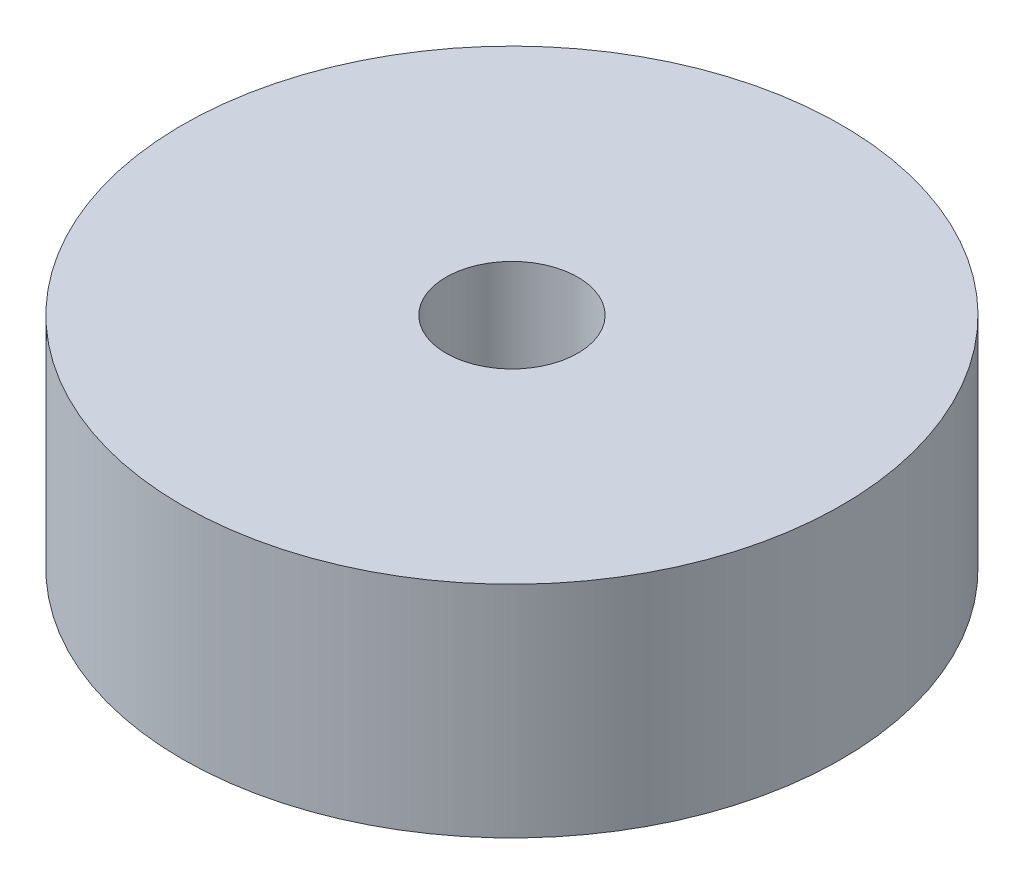
ISO-10303-21;
HEADER;
FILE_DESCRIPTION(('STEP AP214'),'2;1');
FILE_NAME('part.step','',(''),(''),'','','');
FILE_SCHEMA(('AUTOMOTIVE_DESIGN { 1 0 10303 214 1 1 1 1 }'));
ENDSEC;
DATA;
#1=APPLICATION_CONTEXT('core data for automotive mechanical design processes');
#2=APPLICATION_PROTOCOL_DEFINITION('international standard','automotive_design',2000,#1);
#3=PRODUCT_CONTEXT('',#1,'mechanical');
#4=PRODUCT('Part','Part','',(#3));
#5=PRODUCT_RELATED_PRODUCT_CATEGORY('part','',(#4));
#6=PRODUCT_DEFINITION_FORMATION('','',#4);
#7=PRODUCT_DEFINITION_CONTEXT('part definition',#1,'design');
#8=PRODUCT_DEFINITION('design','',#6,#7);
#9=PRODUCT_DEFINITION_SHAPE('','',#8);
#10=(LENGTH_UNIT() NAMED_UNIT(*) SI_UNIT(.MILLI.,.METRE.));
#11=(NAMED_UNIT(*) PLANE_ANGLE_UNIT() SI_UNIT($,.RADIAN.));
#12=(NAMED_UNIT(*) SI_UNIT($,.STERADIAN.) SOLID_ANGLE_UNIT());
#13=UNCERTAINTY_MEASURE_WITH_UNIT(LENGTH_MEASURE(1.E-05),#10,'distance_accuracy_value','');
#14=(GEOMETRIC_REPRESENTATION_CONTEXT(3) GLOBAL_UNCERTAINTY_ASSIGNED_CONTEXT((#13)) GLOBAL_UNIT_ASSIGNED_CONTEXT((#10,
#11,#12)) REPRESENTATION_CONTEXT('',''));
#15=CARTESIAN_POINT('',(0.,0.,0.));
#16=DIRECTION('',(0.,0.,1.));
#17=DIRECTION('',(1.,0.,0.));
#18=AXIS2_PLACEMENT_3D('',#15,#16,#17);
#19=CARTESIAN_POINT('',(0.,10.,0.));
#20=DIRECTION('',(0.,1.,0.));
#21=DIRECTION('',(0.,0.,1.));
#22=AXIS2_PLACEMENT_3D('',#19,#20,#21);
#23=PLANE('',#22);
#24=CARTESIAN_POINT('',(0.,10.,0.));
#25=DIRECTION('',(0.,1.,0.));
#26=DIRECTION('',(0.,0.,1.));
#27=AXIS2_PLACEMENT_3D('',#24,#25,#26);
#28=CIRCLE('',#27,15.);
#29=CARTESIAN_POINT('',(0.,10.,15.));
#30=VERTEX_POINT('',#29);
#31=EDGE_CURVE('E10',#30,#30,#28,.T.);
#32=ORIENTED_EDGE('',*,*,#31,.T.);
#33=EDGE_LOOP('',(#32));
#34=FACE_BOUND('',#33,.T.);
#35=CARTESIAN_POINT('',(0.,10.,0.));
#36=DIRECTION('',(0.,1.,0.));
#37=DIRECTION('',(0.,0.,1.));
#38=AXIS2_PLACEMENT_3D('',#35,#36,#37);
#39=CIRCLE('',#38,3.);
#40=CARTESIAN_POINT('',(0.,10.,3.));
#41=VERTEX_POINT('',#40);
#42=EDGE_CURVE('E42',#41,#41,#39,.T.);
#43=ORIENTED_EDGE('',*,*,#42,.F.);
#44=EDGE_LOOP('',(#43));
#45=FACE_BOUND('',#44,.T.);
#46=ADVANCED_FACE('F31',(#34,#45),#23,.T.);
#47=CARTESIAN_POINT('',(0.,0.,0.));
#48=DIRECTION('',(0.,1.,0.));
#49=DIRECTION('',(0.,0.,1.));
#50=AXIS2_PLACEMENT_3D('',#47,#48,#49);
#51=PLANE('',#50);
#52=CARTESIAN_POINT('',(0.,0.,0.));
#53=DIRECTION('',(0.,1.,0.));
#54=DIRECTION('',(0.,0.,1.));
#55=AXIS2_PLACEMENT_3D('',#52,#53,#54);
#56=CIRCLE('',#55,15.);
#57=CARTESIAN_POINT('',(0.,0.,15.));
#58=VERTEX_POINT('',#57);
#59=EDGE_CURVE('E35',#58,#58,#56,.T.);
#60=ORIENTED_EDGE('',*,*,#59,.F.);
#61=EDGE_LOOP('',(#60));
#62=FACE_BOUND('',#61,.T.);
#63=CARTESIAN_POINT('',(0.,0.,0.));
#64=DIRECTION('',(0.,1.,0.));
#65=DIRECTION('',(0.,0.,1.));
#66=AXIS2_PLACEMENT_3D('',#63,#64,#65);
#67=CIRCLE('',#66,3.);
#68=CARTESIAN_POINT('',(0.,0.,3.));
#69=VERTEX_POINT('',#68);
#70=EDGE_CURVE('E44',#69,#69,#67,.T.);
#71=ORIENTED_EDGE('',*,*,#70,.T.);
#72=EDGE_LOOP('',(#71));
#73=FACE_BOUND('',#72,.T.);
#74=ADVANCED_FACE('F54',(#62,#73),#51,.F.);
#75=CARTESIAN_POINT('',(0.,10.,0.));
#76=DIRECTION('',(0.,-1.,0.));
#77=DIRECTION('',(0.,0.,-1.));
#78=AXIS2_PLACEMENT_3D('',#75,#76,#77);
#79=CYLINDRICAL_SURFACE('',#78,15.);
#80=ORIENTED_EDGE('',*,*,#31,.F.);
#81=EDGE_LOOP('',(#80));
#82=FACE_BOUND('',#81,.T.);
#83=ORIENTED_EDGE('',*,*,#59,.T.);
#84=EDGE_LOOP('',(#83));
#85=FACE_BOUND('',#84,.T.);
#86=ADVANCED_FACE('F33',(#82,#85),#79,.T.);
#87=CARTESIAN_POINT('',(0.,10.,0.));
#88=DIRECTION('',(0.,-1.,0.));
#89=DIRECTION('',(0.,0.,-1.));
#90=AXIS2_PLACEMENT_3D('',#87,#88,#89);
#91=CYLINDRICAL_SURFACE('',#90,3.);
#92=ORIENTED_EDGE('',*,*,#42,.T.);
#93=EDGE_LOOP('',(#92));
#94=FACE_BOUND('',#93,.T.);
#95=ORIENTED_EDGE('',*,*,#70,.F.);
#96=EDGE_LOOP('',(#95));
#97=FACE_BOUND('',#96,.T.);
#98=ADVANCED_FACE('F50',(#94,#97),#91,.F.);
#99=CLOSED_SHELL('',(#46,#74,#86,#98));
#100=MANIFOLD_SOLID_BREP('B2',#99);
#101=ADVANCED_BREP_SHAPE_REPRESENTATION('',(#18,#100),#14);
#102=SHAPE_DEFINITION_REPRESENTATION(#9,#101);
ENDSEC;
END-ISO-10303-21;
